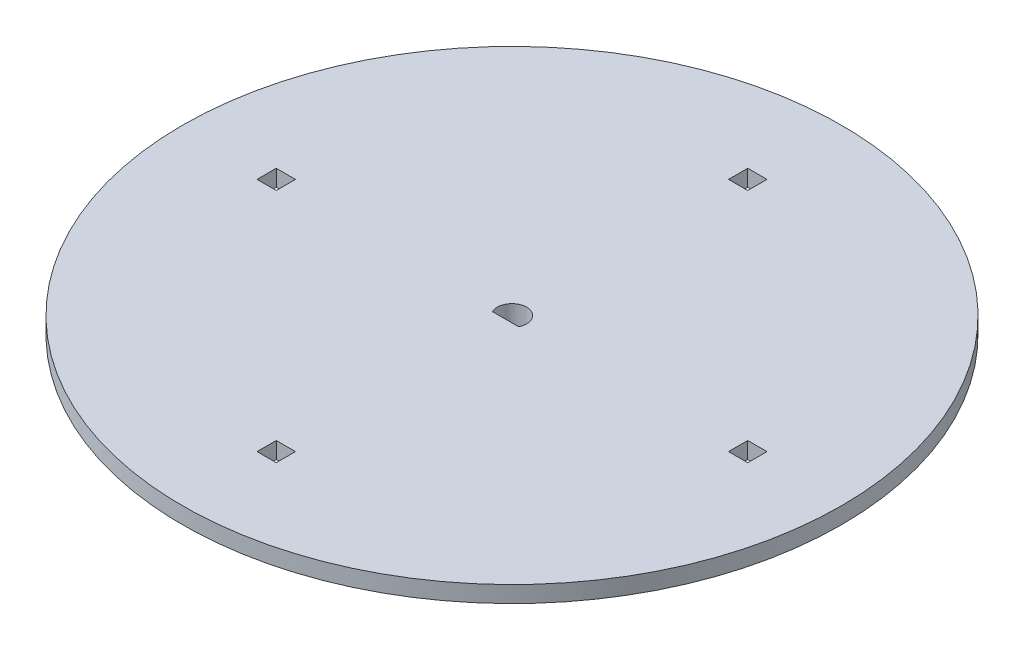
ISO-10303-21;
HEADER;
FILE_DESCRIPTION(('STEP AP214'),'2;1');
FILE_NAME('part.step','',(''),(''),'','','');
FILE_SCHEMA(('AUTOMOTIVE_DESIGN { 1 0 10303 214 1 1 1 1 }'));
ENDSEC;
DATA;
#1=APPLICATION_CONTEXT('core data for automotive mechanical design processes');
#2=APPLICATION_PROTOCOL_DEFINITION('international standard','automotive_design',2000,#1);
#3=PRODUCT_CONTEXT('',#1,'mechanical');
#4=PRODUCT('Part','Part','',(#3));
#5=PRODUCT_RELATED_PRODUCT_CATEGORY('part','',(#4));
#6=PRODUCT_DEFINITION_FORMATION('','',#4);
#7=PRODUCT_DEFINITION_CONTEXT('part definition',#1,'design');
#8=PRODUCT_DEFINITION('design','',#6,#7);
#9=PRODUCT_DEFINITION_SHAPE('','',#8);
#10=(LENGTH_UNIT() NAMED_UNIT(*) SI_UNIT(.MILLI.,.METRE.));
#11=(NAMED_UNIT(*) PLANE_ANGLE_UNIT() SI_UNIT($,.RADIAN.));
#12=(NAMED_UNIT(*) SI_UNIT($,.STERADIAN.) SOLID_ANGLE_UNIT());
#13=UNCERTAINTY_MEASURE_WITH_UNIT(LENGTH_MEASURE(1.E-05),#10,'distance_accuracy_value','');
#14=(GEOMETRIC_REPRESENTATION_CONTEXT(3) GLOBAL_UNCERTAINTY_ASSIGNED_CONTEXT((#13)) GLOBAL_UNIT_ASSIGNED_CONTEXT((#10,
#11,#12)) REPRESENTATION_CONTEXT('',''));
#15=CARTESIAN_POINT('',(0.,0.,0.));
#16=DIRECTION('',(0.,0.,1.));
#17=DIRECTION('',(1.,0.,0.));
#18=AXIS2_PLACEMENT_3D('',#15,#16,#17);
#19=CARTESIAN_POINT('',(0.,0.,0.));
#20=DIRECTION('',(0.,1.,0.));
#21=DIRECTION('',(-1.,0.,0.));
#22=AXIS2_PLACEMENT_3D('',#19,#20,#21);
#23=CYLINDRICAL_SURFACE('',#22,60.);
#24=CARTESIAN_POINT('',(0.,-3.00000000000001,0.));
#25=DIRECTION('',(0.,1.,0.));
#26=DIRECTION('',(-1.,0.,0.));
#27=AXIS2_PLACEMENT_3D('',#24,#25,#26);
#28=CIRCLE('',#27,60.);
#29=CARTESIAN_POINT('',(-60.,-3.00000000000001,0.));
#30=VERTEX_POINT('',#29);
#31=EDGE_CURVE('E309',#30,#30,#28,.T.);
#32=ORIENTED_EDGE('',*,*,#31,.T.);
#33=EDGE_LOOP('',(#32));
#34=FACE_BOUND('',#33,.T.);
#35=CARTESIAN_POINT('',(0.,0.,0.));
#36=DIRECTION('',(0.,1.,0.));
#37=DIRECTION('',(-1.,0.,0.));
#38=AXIS2_PLACEMENT_3D('',#35,#36,#37);
#39=CIRCLE('',#38,60.);
#40=CARTESIAN_POINT('',(-60.,0.,0.));
#41=VERTEX_POINT('',#40);
#42=EDGE_CURVE('E324',#41,#41,#39,.T.);
#43=ORIENTED_EDGE('',*,*,#42,.F.);
#44=EDGE_LOOP('',(#43));
#45=FACE_BOUND('',#44,.T.);
#46=ADVANCED_FACE('F41',(#34,#45),#23,.T.);
#47=CARTESIAN_POINT('',(0.,0.,0.));
#48=DIRECTION('',(0.,1.,0.));
#49=DIRECTION('',(-1.,0.,0.));
#50=AXIS2_PLACEMENT_3D('',#47,#48,#49);
#51=PLANE('',#50);
#52=DIRECTION('',(0.,0.,1.));
#53=VECTOR('',#52,1.);
#54=CARTESIAN_POINT('',(-1.75,0.,41.17));
#55=LINE('',#54,#53);
#56=CARTESIAN_POINT('',(-1.75,0.,41.17));
#57=VERTEX_POINT('',#56);
#58=CARTESIAN_POINT('',(-1.75,0.,44.67));
#59=VERTEX_POINT('',#58);
#60=EDGE_CURVE('E56',#57,#59,#55,.T.);
#61=ORIENTED_EDGE('',*,*,#60,.F.);
#62=DIRECTION('',(-1.,0.,0.));
#63=VECTOR('',#62,1.);
#64=CARTESIAN_POINT('',(1.75,0.,41.17));
#65=LINE('',#64,#63);
#66=CARTESIAN_POINT('',(1.75,0.,41.17));
#67=VERTEX_POINT('',#66);
#68=EDGE_CURVE('E249',#67,#57,#65,.T.);
#69=ORIENTED_EDGE('',*,*,#68,.F.);
#70=DIRECTION('',(0.,0.,-1.));
#71=VECTOR('',#70,1.);
#72=CARTESIAN_POINT('',(1.75,0.,41.17));
#73=LINE('',#72,#71);
#74=CARTESIAN_POINT('',(1.75,0.,44.67));
#75=VERTEX_POINT('',#74);
#76=EDGE_CURVE('E245',#75,#67,#73,.T.);
#77=ORIENTED_EDGE('',*,*,#76,.F.);
#78=DIRECTION('',(1.,0.,0.));
#79=VECTOR('',#78,1.);
#80=CARTESIAN_POINT('',(1.75,0.,44.67));
#81=LINE('',#80,#79);
#82=EDGE_CURVE('E240',#59,#75,#81,.T.);
#83=ORIENTED_EDGE('',*,*,#82,.F.);
#84=EDGE_LOOP('',(#61,#69,#77,#83));
#85=FACE_BOUND('',#84,.T.);
#86=DIRECTION('',(0.,0.,1.));
#87=VECTOR('',#86,1.);
#88=CARTESIAN_POINT('',(-44.67,0.,1.75));
#89=LINE('',#88,#87);
#90=CARTESIAN_POINT('',(-44.67,0.,-1.75));
#91=VERTEX_POINT('',#90);
#92=CARTESIAN_POINT('',(-44.67,0.,1.75));
#93=VERTEX_POINT('',#92);
#94=EDGE_CURVE('E64',#91,#93,#89,.T.);
#95=ORIENTED_EDGE('',*,*,#94,.F.);
#96=DIRECTION('',(-1.,0.,0.));
#97=VECTOR('',#96,1.);
#98=CARTESIAN_POINT('',(-41.17,0.,-1.75));
#99=LINE('',#98,#97);
#100=CARTESIAN_POINT('',(-41.17,0.,-1.75));
#101=VERTEX_POINT('',#100);
#102=EDGE_CURVE('E276',#101,#91,#99,.T.);
#103=ORIENTED_EDGE('',*,*,#102,.F.);
#104=DIRECTION('',(0.,0.,-1.));
#105=VECTOR('',#104,1.);
#106=CARTESIAN_POINT('',(-41.17,0.,1.75));
#107=LINE('',#106,#105);
#108=CARTESIAN_POINT('',(-41.17,0.,1.75));
#109=VERTEX_POINT('',#108);
#110=EDGE_CURVE('E272',#109,#101,#107,.T.);
#111=ORIENTED_EDGE('',*,*,#110,.F.);
#112=DIRECTION('',(1.,0.,0.));
#113=VECTOR('',#112,1.);
#114=CARTESIAN_POINT('',(-41.17,0.,1.75));
#115=LINE('',#114,#113);
#116=EDGE_CURVE('E268',#93,#109,#115,.T.);
#117=ORIENTED_EDGE('',*,*,#116,.F.);
#118=EDGE_LOOP('',(#95,#103,#111,#117));
#119=FACE_BOUND('',#118,.T.);
#120=DIRECTION('',(-1.,0.,0.));
#121=VECTOR('',#120,1.);
#122=CARTESIAN_POINT('',(-1.75000000000001,0.,-44.67));
#123=LINE('',#122,#121);
#124=CARTESIAN_POINT('',(1.74999999999999,0.,-44.67));
#125=VERTEX_POINT('',#124);
#126=CARTESIAN_POINT('',(-1.75000000000001,0.,-44.67));
#127=VERTEX_POINT('',#126);
#128=EDGE_CURVE('E191',#125,#127,#123,.T.);
#129=ORIENTED_EDGE('',*,*,#128,.F.);
#130=DIRECTION('',(0.,0.,-1.));
#131=VECTOR('',#130,1.);
#132=CARTESIAN_POINT('',(1.74999999999999,0.,-41.17));
#133=LINE('',#132,#131);
#134=CARTESIAN_POINT('',(1.74999999999999,0.,-41.17));
#135=VERTEX_POINT('',#134);
#136=EDGE_CURVE('E196',#135,#125,#133,.T.);
#137=ORIENTED_EDGE('',*,*,#136,.F.);
#138=DIRECTION('',(1.,0.,0.));
#139=VECTOR('',#138,1.);
#140=CARTESIAN_POINT('',(-1.75000000000001,0.,-41.17));
#141=LINE('',#140,#139);
#142=CARTESIAN_POINT('',(-1.75000000000001,0.,-41.17));
#143=VERTEX_POINT('',#142);
#144=EDGE_CURVE('E173',#143,#135,#141,.T.);
#145=ORIENTED_EDGE('',*,*,#144,.F.);
#146=DIRECTION('',(0.,0.,1.));
#147=VECTOR('',#146,1.);
#148=CARTESIAN_POINT('',(-1.75000000000001,0.,-41.17));
#149=LINE('',#148,#147);
#150=EDGE_CURVE('E185',#127,#143,#149,.T.);
#151=ORIENTED_EDGE('',*,*,#150,.F.);
#152=EDGE_LOOP('',(#129,#137,#145,#151));
#153=FACE_BOUND('',#152,.T.);
#154=DIRECTION('',(0.,0.,-1.));
#155=VECTOR('',#154,1.);
#156=CARTESIAN_POINT('',(44.67,0.,-1.75000000000001));
#157=LINE('',#156,#155);
#158=CARTESIAN_POINT('',(44.67,0.,1.74999999999999));
#159=VERTEX_POINT('',#158);
#160=CARTESIAN_POINT('',(44.67,0.,-1.75000000000001));
#161=VERTEX_POINT('',#160);
#162=EDGE_CURVE('E210',#159,#161,#157,.T.);
#163=ORIENTED_EDGE('',*,*,#162,.F.);
#164=DIRECTION('',(1.,0.,0.));
#165=VECTOR('',#164,1.);
#166=CARTESIAN_POINT('',(41.17,0.,1.74999999999999));
#167=LINE('',#166,#165);
#168=CARTESIAN_POINT('',(41.17,0.,1.74999999999999));
#169=VERTEX_POINT('',#168);
#170=EDGE_CURVE('E221',#169,#159,#167,.T.);
#171=ORIENTED_EDGE('',*,*,#170,.F.);
#172=DIRECTION('',(0.,0.,1.));
#173=VECTOR('',#172,1.);
#174=CARTESIAN_POINT('',(41.17,0.,-1.75000000000001));
#175=LINE('',#174,#173);
#176=CARTESIAN_POINT('',(41.17,0.,-1.75000000000001));
#177=VERTEX_POINT('',#176);
#178=EDGE_CURVE('E217',#177,#169,#175,.T.);
#179=ORIENTED_EDGE('',*,*,#178,.F.);
#180=DIRECTION('',(-1.,0.,0.));
#181=VECTOR('',#180,1.);
#182=CARTESIAN_POINT('',(41.17,0.,-1.75000000000001));
#183=LINE('',#182,#181);
#184=EDGE_CURVE('E213',#161,#177,#183,.T.);
#185=ORIENTED_EDGE('',*,*,#184,.F.);
#186=EDGE_LOOP('',(#163,#171,#179,#185));
#187=FACE_BOUND('',#186,.T.);
#188=CARTESIAN_POINT('',(0.,0.,0.));
#189=DIRECTION('',(0.,1.,0.));
#190=DIRECTION('',(-1.,0.,0.));
#191=AXIS2_PLACEMENT_3D('',#188,#189,#190);
#192=CIRCLE('',#191,2.65);
#193=CARTESIAN_POINT('',(2.37773000990441,0.,1.17));
#194=VERTEX_POINT('',#193);
#195=CARTESIAN_POINT('',(-2.37773000990441,0.,1.17));
#196=VERTEX_POINT('',#195);
#197=EDGE_CURVE('E257',#194,#196,#192,.T.);
#198=ORIENTED_EDGE('',*,*,#197,.F.);
#199=DIRECTION('',(1.,0.,0.));
#200=VECTOR('',#199,1.);
#201=CARTESIAN_POINT('',(2.37773000990441,0.,1.17));
#202=LINE('',#201,#200);
#203=EDGE_CURVE('E296',#196,#194,#202,.T.);
#204=ORIENTED_EDGE('',*,*,#203,.F.);
#205=EDGE_LOOP('',(#198,#204));
#206=FACE_BOUND('',#205,.T.);
#207=ORIENTED_EDGE('',*,*,#42,.T.);
#208=EDGE_LOOP('',(#207));
#209=FACE_BOUND('',#208,.T.);
#210=ADVANCED_FACE('F193',(#85,#119,#153,#187,#206,#209),#51,.T.);
#211=CARTESIAN_POINT('',(0.,-7.1086,0.));
#212=DIRECTION('',(0.,1.,0.));
#213=DIRECTION('',(-1.,0.,0.));
#214=AXIS2_PLACEMENT_3D('',#211,#212,#213);
#215=PLANE('',#214);
#216=DIRECTION('',(1.,0.,0.));
#217=VECTOR('',#216,1.);
#218=CARTESIAN_POINT('',(2.37773000990441,-7.10860000000001,1.17));
#219=LINE('',#218,#217);
#220=CARTESIAN_POINT('',(-2.3777300099044,-7.10860000000001,1.17));
#221=VERTEX_POINT('',#220);
#222=CARTESIAN_POINT('',(2.37773000990441,-7.1086,1.17));
#223=VERTEX_POINT('',#222);
#224=EDGE_CURVE('E295',#221,#223,#219,.T.);
#225=ORIENTED_EDGE('',*,*,#224,.T.);
#226=CARTESIAN_POINT('',(0.,-7.10860000000001,0.));
#227=DIRECTION('',(0.,1.,0.));
#228=DIRECTION('',(-1.,0.,0.));
#229=AXIS2_PLACEMENT_3D('',#226,#227,#228);
#230=CIRCLE('',#229,2.65);
#231=EDGE_CURVE('E291',#223,#221,#230,.T.);
#232=ORIENTED_EDGE('',*,*,#231,.T.);
#233=EDGE_LOOP('',(#225,#232));
#234=FACE_BOUND('',#233,.T.);
#235=CARTESIAN_POINT('',(0.,-7.1086,0.));
#236=DIRECTION('',(0.,1.,0.));
#237=DIRECTION('',(-1.,0.,0.));
#238=AXIS2_PLACEMENT_3D('',#235,#236,#237);
#239=CIRCLE('',#238,3.0734);
#240=CARTESIAN_POINT('',(-3.0734,-7.1086,0.));
#241=VERTEX_POINT('',#240);
#242=EDGE_CURVE('E320',#241,#241,#239,.T.);
#243=ORIENTED_EDGE('',*,*,#242,.F.);
#244=EDGE_LOOP('',(#243));
#245=FACE_BOUND('',#244,.T.);
#246=ADVANCED_FACE('F418',(#234,#245),#215,.F.);
#247=CARTESIAN_POINT('',(0.,0.,0.));
#248=DIRECTION('',(0.,1.,0.));
#249=DIRECTION('',(-1.,0.,0.));
#250=AXIS2_PLACEMENT_3D('',#247,#248,#249);
#251=CYLINDRICAL_SURFACE('',#250,3.0734);
#252=ORIENTED_EDGE('',*,*,#242,.T.);
#253=EDGE_LOOP('',(#252));
#254=FACE_BOUND('',#253,.T.);
#255=CARTESIAN_POINT('',(0.,-3.,0.));
#256=DIRECTION('',(0.,1.,0.));
#257=DIRECTION('',(-1.,0.,0.));
#258=AXIS2_PLACEMENT_3D('',#255,#256,#257);
#259=CIRCLE('',#258,3.0734);
#260=CARTESIAN_POINT('',(-3.0734,-3.,0.));
#261=VERTEX_POINT('',#260);
#262=EDGE_CURVE('E316',#261,#261,#259,.T.);
#263=ORIENTED_EDGE('',*,*,#262,.F.);
#264=EDGE_LOOP('',(#263));
#265=FACE_BOUND('',#264,.T.);
#266=ADVANCED_FACE('F427',(#254,#265),#251,.T.);
#267=CARTESIAN_POINT('',(0.,-3.,0.));
#268=DIRECTION('',(0.,1.,0.));
#269=DIRECTION('',(-1.,0.,0.));
#270=AXIS2_PLACEMENT_3D('',#267,#268,#269);
#271=PLANE('',#270);
#272=DIRECTION('',(-1.,0.,0.));
#273=VECTOR('',#272,1.);
#274=CARTESIAN_POINT('',(0.,-3.,41.17));
#275=LINE('',#274,#273);
#276=CARTESIAN_POINT('',(1.75,-3.,41.17));
#277=VERTEX_POINT('',#276);
#278=CARTESIAN_POINT('',(-1.75,-3.,41.17));
#279=VERTEX_POINT('',#278);
#280=EDGE_CURVE('E49',#277,#279,#275,.T.);
#281=ORIENTED_EDGE('',*,*,#280,.T.);
#282=DIRECTION('',(0.,0.,1.));
#283=VECTOR('',#282,1.);
#284=CARTESIAN_POINT('',(-1.75,-3.,0.));
#285=LINE('',#284,#283);
#286=CARTESIAN_POINT('',(-1.75,-3.,44.67));
#287=VERTEX_POINT('',#286);
#288=EDGE_CURVE('E11',#279,#287,#285,.T.);
#289=ORIENTED_EDGE('',*,*,#288,.T.);
#290=DIRECTION('',(1.,0.,0.));
#291=VECTOR('',#290,1.);
#292=CARTESIAN_POINT('',(0.,-3.,44.67));
#293=LINE('',#292,#291);
#294=CARTESIAN_POINT('',(1.75,-3.,44.67));
#295=VERTEX_POINT('',#294);
#296=EDGE_CURVE('E373',#287,#295,#293,.T.);
#297=ORIENTED_EDGE('',*,*,#296,.T.);
#298=DIRECTION('',(0.,0.,-1.));
#299=VECTOR('',#298,1.);
#300=CARTESIAN_POINT('',(1.75,-3.,0.));
#301=LINE('',#300,#299);
#302=EDGE_CURVE('E377',#295,#277,#301,.T.);
#303=ORIENTED_EDGE('',*,*,#302,.T.);
#304=EDGE_LOOP('',(#281,#289,#297,#303));
#305=FACE_BOUND('',#304,.T.);
#306=DIRECTION('',(-1.,0.,0.));
#307=VECTOR('',#306,1.);
#308=CARTESIAN_POINT('',(0.,-3.,-1.75));
#309=LINE('',#308,#307);
#310=CARTESIAN_POINT('',(-41.17,-3.00000000000001,-1.75));
#311=VERTEX_POINT('',#310);
#312=CARTESIAN_POINT('',(-44.67,-3.00000000000001,-1.75));
#313=VERTEX_POINT('',#312);
#314=EDGE_CURVE('E365',#311,#313,#309,.T.);
#315=ORIENTED_EDGE('',*,*,#314,.T.);
#316=DIRECTION('',(0.,0.,1.));
#317=VECTOR('',#316,1.);
#318=CARTESIAN_POINT('',(-44.67,-3.00000000000001,0.));
#319=LINE('',#318,#317);
#320=CARTESIAN_POINT('',(-44.67,-3.00000000000001,1.75));
#321=VERTEX_POINT('',#320);
#322=EDGE_CURVE('E369',#313,#321,#319,.T.);
#323=ORIENTED_EDGE('',*,*,#322,.T.);
#324=DIRECTION('',(1.,0.,0.));
#325=VECTOR('',#324,1.);
#326=CARTESIAN_POINT('',(0.,-3.,1.75));
#327=LINE('',#326,#325);
#328=CARTESIAN_POINT('',(-41.17,-3.00000000000001,1.75));
#329=VERTEX_POINT('',#328);
#330=EDGE_CURVE('E357',#321,#329,#327,.T.);
#331=ORIENTED_EDGE('',*,*,#330,.T.);
#332=DIRECTION('',(0.,0.,-1.));
#333=VECTOR('',#332,1.);
#334=CARTESIAN_POINT('',(-41.17,-3.00000000000001,0.));
#335=LINE('',#334,#333);
#336=EDGE_CURVE('E361',#329,#311,#335,.T.);
#337=ORIENTED_EDGE('',*,*,#336,.T.);
#338=EDGE_LOOP('',(#315,#323,#331,#337));
#339=FACE_BOUND('',#338,.T.);
#340=DIRECTION('',(0.,0.,-1.));
#341=VECTOR('',#340,1.);
#342=CARTESIAN_POINT('',(1.75000000000001,-3.,0.));
#343=LINE('',#342,#341);
#344=CARTESIAN_POINT('',(1.75,-3.,-41.17));
#345=VERTEX_POINT('',#344);
#346=CARTESIAN_POINT('',(1.74999999999999,-3.,-44.67));
#347=VERTEX_POINT('',#346);
#348=EDGE_CURVE('E349',#345,#347,#343,.T.);
#349=ORIENTED_EDGE('',*,*,#348,.T.);
#350=DIRECTION('',(-1.,0.,0.));
#351=VECTOR('',#350,1.);
#352=CARTESIAN_POINT('',(0.,-3.,-44.67));
#353=LINE('',#352,#351);
#354=CARTESIAN_POINT('',(-1.75000000000001,-3.,-44.67));
#355=VERTEX_POINT('',#354);
#356=EDGE_CURVE('E353',#347,#355,#353,.T.);
#357=ORIENTED_EDGE('',*,*,#356,.T.);
#358=DIRECTION('',(0.,0.,1.));
#359=VECTOR('',#358,1.);
#360=CARTESIAN_POINT('',(-1.74999999999999,-3.,0.));
#361=LINE('',#360,#359);
#362=CARTESIAN_POINT('',(-1.75,-3.,-41.17));
#363=VERTEX_POINT('',#362);
#364=EDGE_CURVE('E344',#355,#363,#361,.T.);
#365=ORIENTED_EDGE('',*,*,#364,.T.);
#366=DIRECTION('',(1.,0.,0.));
#367=VECTOR('',#366,1.);
#368=CARTESIAN_POINT('',(0.,-3.,-41.17));
#369=LINE('',#368,#367);
#370=EDGE_CURVE('E176',#363,#345,#369,.T.);
#371=ORIENTED_EDGE('',*,*,#370,.T.);
#372=EDGE_LOOP('',(#349,#357,#365,#371));
#373=FACE_BOUND('',#372,.T.);
#374=DIRECTION('',(1.,0.,0.));
#375=VECTOR('',#374,1.);
#376=CARTESIAN_POINT('',(0.,-3.,1.75));
#377=LINE('',#376,#375);
#378=CARTESIAN_POINT('',(41.17,-3.,1.74999999999999));
#379=VERTEX_POINT('',#378);
#380=CARTESIAN_POINT('',(44.67,-3.,1.74999999999999));
#381=VERTEX_POINT('',#380);
#382=EDGE_CURVE('E336',#379,#381,#377,.T.);
#383=ORIENTED_EDGE('',*,*,#382,.T.);
#384=DIRECTION('',(0.,0.,-1.));
#385=VECTOR('',#384,1.);
#386=CARTESIAN_POINT('',(44.67,-3.,0.));
#387=LINE('',#386,#385);
#388=CARTESIAN_POINT('',(44.67,-3.,-1.75000000000001));
#389=VERTEX_POINT('',#388);
#390=EDGE_CURVE('E340',#381,#389,#387,.T.);
#391=ORIENTED_EDGE('',*,*,#390,.T.);
#392=DIRECTION('',(-1.,0.,0.));
#393=VECTOR('',#392,1.);
#394=CARTESIAN_POINT('',(0.,-3.,-1.74999999999999));
#395=LINE('',#394,#393);
#396=CARTESIAN_POINT('',(41.17,-3.,-1.75000000000001));
#397=VERTEX_POINT('',#396);
#398=EDGE_CURVE('E328',#389,#397,#395,.T.);
#399=ORIENTED_EDGE('',*,*,#398,.T.);
#400=DIRECTION('',(0.,0.,1.));
#401=VECTOR('',#400,1.);
#402=CARTESIAN_POINT('',(41.17,-3.,0.));
#403=LINE('',#402,#401);
#404=EDGE_CURVE('E332',#397,#379,#403,.T.);
#405=ORIENTED_EDGE('',*,*,#404,.T.);
#406=EDGE_LOOP('',(#383,#391,#399,#405));
#407=FACE_BOUND('',#406,.T.);
#408=ORIENTED_EDGE('',*,*,#31,.F.);
#409=EDGE_LOOP('',(#408));
#410=FACE_BOUND('',#409,.T.);
#411=ORIENTED_EDGE('',*,*,#262,.T.);
#412=EDGE_LOOP('',(#411));
#413=FACE_BOUND('',#412,.T.);
#414=ADVANCED_FACE('F383',(#305,#339,#373,#407,#410,#413),#271,.F.);
#415=CARTESIAN_POINT('',(44.67,-7.1086,-1.75000000000001));
#416=DIRECTION('',(1.,0.,0.));
#417=DIRECTION('',(0.,1.,0.));
#418=AXIS2_PLACEMENT_3D('',#415,#416,#417);
#419=PLANE('',#418);
#420=DIRECTION('',(0.,1.,0.));
#421=VECTOR('',#420,1.);
#422=CARTESIAN_POINT('',(44.67,-7.1086,1.74999999999999));
#423=LINE('',#422,#421);
#424=EDGE_CURVE('E226',#381,#159,#423,.T.);
#425=ORIENTED_EDGE('',*,*,#424,.T.);
#426=ORIENTED_EDGE('',*,*,#162,.T.);
#427=DIRECTION('',(0.,1.,0.));
#428=VECTOR('',#427,1.);
#429=CARTESIAN_POINT('',(44.67,-7.1086,-1.75000000000001));
#430=LINE('',#429,#428);
#431=EDGE_CURVE('E225',#389,#161,#430,.T.);
#432=ORIENTED_EDGE('',*,*,#431,.F.);
#433=ORIENTED_EDGE('',*,*,#390,.F.);
#434=EDGE_LOOP('',(#425,#426,#432,#433));
#435=FACE_BOUND('',#434,.T.);
#436=ADVANCED_FACE('F426',(#435),#419,.F.);
#437=CARTESIAN_POINT('',(41.17,-7.1086,1.74999999999999));
#438=DIRECTION('',(0.,0.,1.));
#439=DIRECTION('',(1.,0.,0.));
#440=AXIS2_PLACEMENT_3D('',#437,#438,#439);
#441=PLANE('',#440);
#442=DIRECTION('',(0.,1.,0.));
#443=VECTOR('',#442,1.);
#444=CARTESIAN_POINT('',(41.17,-7.1086,1.74999999999999));
#445=LINE('',#444,#443);
#446=EDGE_CURVE('E229',#379,#169,#445,.T.);
#447=ORIENTED_EDGE('',*,*,#446,.T.);
#448=ORIENTED_EDGE('',*,*,#170,.T.);
#449=ORIENTED_EDGE('',*,*,#424,.F.);
#450=ORIENTED_EDGE('',*,*,#382,.F.);
#451=EDGE_LOOP('',(#447,#448,#449,#450));
#452=FACE_BOUND('',#451,.T.);
#453=ADVANCED_FACE('F470',(#452),#441,.F.);
#454=CARTESIAN_POINT('',(41.17,-7.1086,-1.75000000000001));
#455=DIRECTION('',(-1.,0.,0.));
#456=DIRECTION('',(0.,-1.,0.));
#457=AXIS2_PLACEMENT_3D('',#454,#455,#456);
#458=PLANE('',#457);
#459=DIRECTION('',(0.,1.,0.));
#460=VECTOR('',#459,1.);
#461=CARTESIAN_POINT('',(41.17,-7.1086,-1.75000000000001));
#462=LINE('',#461,#460);
#463=EDGE_CURVE('E232',#397,#177,#462,.T.);
#464=ORIENTED_EDGE('',*,*,#463,.T.);
#465=ORIENTED_EDGE('',*,*,#178,.T.);
#466=ORIENTED_EDGE('',*,*,#446,.F.);
#467=ORIENTED_EDGE('',*,*,#404,.F.);
#468=EDGE_LOOP('',(#464,#465,#466,#467));
#469=FACE_BOUND('',#468,.T.);
#470=ADVANCED_FACE('F472',(#469),#458,.F.);
#471=CARTESIAN_POINT('',(41.17,-7.1086,-1.75000000000001));
#472=DIRECTION('',(0.,0.,-1.));
#473=DIRECTION('',(-1.,0.,0.));
#474=AXIS2_PLACEMENT_3D('',#471,#472,#473);
#475=PLANE('',#474);
#476=ORIENTED_EDGE('',*,*,#431,.T.);
#477=ORIENTED_EDGE('',*,*,#184,.T.);
#478=ORIENTED_EDGE('',*,*,#463,.F.);
#479=ORIENTED_EDGE('',*,*,#398,.F.);
#480=EDGE_LOOP('',(#476,#477,#478,#479));
#481=FACE_BOUND('',#480,.T.);
#482=ADVANCED_FACE('F481',(#481),#475,.F.);
#483=CARTESIAN_POINT('',(-1.75000000000001,-7.10860000000001,-44.67));
#484=DIRECTION('',(0.,0.,-1.));
#485=DIRECTION('',(-1.,0.,0.));
#486=AXIS2_PLACEMENT_3D('',#483,#484,#485);
#487=PLANE('',#486);
#488=DIRECTION('',(0.,1.,0.));
#489=VECTOR('',#488,1.);
#490=CARTESIAN_POINT('',(1.74999999999999,-7.10860000000001,-44.67));
#491=LINE('',#490,#489);
#492=EDGE_CURVE('E203',#347,#125,#491,.T.);
#493=ORIENTED_EDGE('',*,*,#492,.T.);
#494=ORIENTED_EDGE('',*,*,#128,.T.);
#495=DIRECTION('',(0.,1.,0.));
#496=VECTOR('',#495,1.);
#497=CARTESIAN_POINT('',(-1.75000000000001,-7.10860000000001,-44.67));
#498=LINE('',#497,#496);
#499=EDGE_CURVE('E181',#355,#127,#498,.T.);
#500=ORIENTED_EDGE('',*,*,#499,.F.);
#501=ORIENTED_EDGE('',*,*,#356,.F.);
#502=EDGE_LOOP('',(#493,#494,#500,#501));
#503=FACE_BOUND('',#502,.T.);
#504=ADVANCED_FACE('F483',(#503),#487,.F.);
#505=CARTESIAN_POINT('',(1.75,-7.10860000000001,-41.17));
#506=DIRECTION('',(1.,0.,0.));
#507=DIRECTION('',(0.,0.,-1.));
#508=AXIS2_PLACEMENT_3D('',#505,#506,#507);
#509=PLANE('',#508);
#510=DIRECTION('',(0.,1.,0.));
#511=VECTOR('',#510,1.);
#512=CARTESIAN_POINT('',(1.75,-7.10860000000001,-41.17));
#513=LINE('',#512,#511);
#514=EDGE_CURVE('E180',#345,#135,#513,.T.);
#515=ORIENTED_EDGE('',*,*,#514,.T.);
#516=ORIENTED_EDGE('',*,*,#136,.T.);
#517=ORIENTED_EDGE('',*,*,#492,.F.);
#518=ORIENTED_EDGE('',*,*,#348,.F.);
#519=EDGE_LOOP('',(#515,#516,#517,#518));
#520=FACE_BOUND('',#519,.T.);
#521=ADVANCED_FACE('F489',(#520),#509,.F.);
#522=CARTESIAN_POINT('',(-1.75,-7.10860000000001,-41.17));
#523=DIRECTION('',(0.,0.,1.));
#524=DIRECTION('',(1.,0.,0.));
#525=AXIS2_PLACEMENT_3D('',#522,#523,#524);
#526=PLANE('',#525);
#527=DIRECTION('',(0.,1.,0.));
#528=VECTOR('',#527,1.);
#529=CARTESIAN_POINT('',(-1.75,-7.10860000000001,-41.17));
#530=LINE('',#529,#528);
#531=EDGE_CURVE('E168',#363,#143,#530,.T.);
#532=ORIENTED_EDGE('',*,*,#531,.T.);
#533=ORIENTED_EDGE('',*,*,#144,.T.);
#534=ORIENTED_EDGE('',*,*,#514,.F.);
#535=ORIENTED_EDGE('',*,*,#370,.F.);
#536=EDGE_LOOP('',(#532,#533,#534,#535));
#537=FACE_BOUND('',#536,.T.);
#538=ADVANCED_FACE('F170',(#537),#526,.F.);
#539=CARTESIAN_POINT('',(-1.75,-7.10860000000001,-41.17));
#540=DIRECTION('',(-1.,0.,0.));
#541=DIRECTION('',(0.,0.,1.));
#542=AXIS2_PLACEMENT_3D('',#539,#540,#541);
#543=PLANE('',#542);
#544=ORIENTED_EDGE('',*,*,#499,.T.);
#545=ORIENTED_EDGE('',*,*,#150,.T.);
#546=ORIENTED_EDGE('',*,*,#531,.F.);
#547=ORIENTED_EDGE('',*,*,#364,.F.);
#548=EDGE_LOOP('',(#544,#545,#546,#547));
#549=FACE_BOUND('',#548,.T.);
#550=ADVANCED_FACE('F186',(#549),#543,.F.);
#551=CARTESIAN_POINT('',(-44.67,-7.10860000000001,1.75));
#552=DIRECTION('',(-1.,0.,0.));
#553=DIRECTION('',(0.,-1.,0.));
#554=AXIS2_PLACEMENT_3D('',#551,#552,#553);
#555=PLANE('',#554);
#556=DIRECTION('',(0.,1.,0.));
#557=VECTOR('',#556,1.);
#558=CARTESIAN_POINT('',(-44.67,-7.10860000000001,-1.75));
#559=LINE('',#558,#557);
#560=EDGE_CURVE('E241',#313,#91,#559,.T.);
#561=ORIENTED_EDGE('',*,*,#560,.T.);
#562=ORIENTED_EDGE('',*,*,#94,.T.);
#563=DIRECTION('',(0.,1.,0.));
#564=VECTOR('',#563,1.);
#565=CARTESIAN_POINT('',(-44.67,-7.10860000000001,1.75));
#566=LINE('',#565,#564);
#567=EDGE_CURVE('E280',#321,#93,#566,.T.);
#568=ORIENTED_EDGE('',*,*,#567,.F.);
#569=ORIENTED_EDGE('',*,*,#322,.F.);
#570=EDGE_LOOP('',(#561,#562,#568,#569));
#571=FACE_BOUND('',#570,.T.);
#572=ADVANCED_FACE('F448',(#571),#555,.F.);
#573=CARTESIAN_POINT('',(-41.17,-7.10860000000001,-1.75));
#574=DIRECTION('',(0.,0.,-1.));
#575=DIRECTION('',(-1.,0.,0.));
#576=AXIS2_PLACEMENT_3D('',#573,#574,#575);
#577=PLANE('',#576);
#578=DIRECTION('',(0.,1.,0.));
#579=VECTOR('',#578,1.);
#580=CARTESIAN_POINT('',(-41.17,-7.10860000000001,-1.75));
#581=LINE('',#580,#579);
#582=EDGE_CURVE('E283',#311,#101,#581,.T.);
#583=ORIENTED_EDGE('',*,*,#582,.T.);
#584=ORIENTED_EDGE('',*,*,#102,.T.);
#585=ORIENTED_EDGE('',*,*,#560,.F.);
#586=ORIENTED_EDGE('',*,*,#314,.F.);
#587=EDGE_LOOP('',(#583,#584,#585,#586));
#588=FACE_BOUND('',#587,.T.);
#589=ADVANCED_FACE('F450',(#588),#577,.F.);
#590=CARTESIAN_POINT('',(-41.17,-7.10860000000001,1.75));
#591=DIRECTION('',(1.,0.,0.));
#592=DIRECTION('',(0.,1.,0.));
#593=AXIS2_PLACEMENT_3D('',#590,#591,#592);
#594=PLANE('',#593);
#595=DIRECTION('',(0.,1.,0.));
#596=VECTOR('',#595,1.);
#597=CARTESIAN_POINT('',(-41.17,-7.10860000000001,1.75));
#598=LINE('',#597,#596);
#599=EDGE_CURVE('E286',#329,#109,#598,.T.);
#600=ORIENTED_EDGE('',*,*,#599,.T.);
#601=ORIENTED_EDGE('',*,*,#110,.T.);
#602=ORIENTED_EDGE('',*,*,#582,.F.);
#603=ORIENTED_EDGE('',*,*,#336,.F.);
#604=EDGE_LOOP('',(#600,#601,#602,#603));
#605=FACE_BOUND('',#604,.T.);
#606=ADVANCED_FACE('F408',(#605),#594,.F.);
#607=CARTESIAN_POINT('',(-41.17,-7.10860000000001,1.75));
#608=DIRECTION('',(0.,0.,1.));
#609=DIRECTION('',(1.,0.,0.));
#610=AXIS2_PLACEMENT_3D('',#607,#608,#609);
#611=PLANE('',#610);
#612=ORIENTED_EDGE('',*,*,#567,.T.);
#613=ORIENTED_EDGE('',*,*,#116,.T.);
#614=ORIENTED_EDGE('',*,*,#599,.F.);
#615=ORIENTED_EDGE('',*,*,#330,.F.);
#616=EDGE_LOOP('',(#612,#613,#614,#615));
#617=FACE_BOUND('',#616,.T.);
#618=ADVANCED_FACE('F401',(#617),#611,.F.);
#619=CARTESIAN_POINT('',(-1.75,-7.10860000000001,41.17));
#620=DIRECTION('',(-1.,0.,0.));
#621=DIRECTION('',(0.,0.,1.));
#622=AXIS2_PLACEMENT_3D('',#619,#620,#621);
#623=PLANE('',#622);
#624=DIRECTION('',(0.,1.,0.));
#625=VECTOR('',#624,1.);
#626=CARTESIAN_POINT('',(-1.75,-7.10860000000001,41.17));
#627=LINE('',#626,#625);
#628=EDGE_CURVE('E254',#279,#57,#627,.T.);
#629=ORIENTED_EDGE('',*,*,#628,.T.);
#630=ORIENTED_EDGE('',*,*,#60,.T.);
#631=DIRECTION('',(0.,1.,0.));
#632=VECTOR('',#631,1.);
#633=CARTESIAN_POINT('',(-1.75,-7.10860000000001,44.67));
#634=LINE('',#633,#632);
#635=EDGE_CURVE('E253',#287,#59,#634,.T.);
#636=ORIENTED_EDGE('',*,*,#635,.F.);
#637=ORIENTED_EDGE('',*,*,#288,.F.);
#638=EDGE_LOOP('',(#629,#630,#636,#637));
#639=FACE_BOUND('',#638,.T.);
#640=ADVANCED_FACE('F399',(#639),#623,.F.);
#641=CARTESIAN_POINT('',(1.75,-7.10860000000001,41.17));
#642=DIRECTION('',(0.,0.,-1.));
#643=DIRECTION('',(-1.,0.,0.));
#644=AXIS2_PLACEMENT_3D('',#641,#642,#643);
#645=PLANE('',#644);
#646=DIRECTION('',(0.,1.,0.));
#647=VECTOR('',#646,1.);
#648=CARTESIAN_POINT('',(1.75,-7.10860000000001,41.17));
#649=LINE('',#648,#647);
#650=EDGE_CURVE('E258',#277,#67,#649,.T.);
#651=ORIENTED_EDGE('',*,*,#650,.T.);
#652=ORIENTED_EDGE('',*,*,#68,.T.);
#653=ORIENTED_EDGE('',*,*,#628,.F.);
#654=ORIENTED_EDGE('',*,*,#280,.F.);
#655=EDGE_LOOP('',(#651,#652,#653,#654));
#656=FACE_BOUND('',#655,.T.);
#657=ADVANCED_FACE('F389',(#656),#645,.F.);
#658=CARTESIAN_POINT('',(1.75,-7.10860000000001,41.17));
#659=DIRECTION('',(1.,0.,0.));
#660=DIRECTION('',(0.,0.,-1.));
#661=AXIS2_PLACEMENT_3D('',#658,#659,#660);
#662=PLANE('',#661);
#663=DIRECTION('',(0.,1.,0.));
#664=VECTOR('',#663,1.);
#665=CARTESIAN_POINT('',(1.75,-7.10860000000001,44.67));
#666=LINE('',#665,#664);
#667=EDGE_CURVE('E261',#295,#75,#666,.T.);
#668=ORIENTED_EDGE('',*,*,#667,.T.);
#669=ORIENTED_EDGE('',*,*,#76,.T.);
#670=ORIENTED_EDGE('',*,*,#650,.F.);
#671=ORIENTED_EDGE('',*,*,#302,.F.);
#672=EDGE_LOOP('',(#668,#669,#670,#671));
#673=FACE_BOUND('',#672,.T.);
#674=ADVANCED_FACE('F391',(#673),#662,.F.);
#675=CARTESIAN_POINT('',(1.75,-7.10860000000001,44.67));
#676=DIRECTION('',(0.,0.,1.));
#677=DIRECTION('',(1.,0.,0.));
#678=AXIS2_PLACEMENT_3D('',#675,#676,#677);
#679=PLANE('',#678);
#680=ORIENTED_EDGE('',*,*,#635,.T.);
#681=ORIENTED_EDGE('',*,*,#82,.T.);
#682=ORIENTED_EDGE('',*,*,#667,.F.);
#683=ORIENTED_EDGE('',*,*,#296,.F.);
#684=EDGE_LOOP('',(#680,#681,#682,#683));
#685=FACE_BOUND('',#684,.T.);
#686=ADVANCED_FACE('F398',(#685),#679,.F.);
#687=CARTESIAN_POINT('',(0.,-7.10860000000001,0.));
#688=DIRECTION('',(0.,1.,0.));
#689=DIRECTION('',(-1.,0.,0.));
#690=AXIS2_PLACEMENT_3D('',#687,#688,#689);
#691=CYLINDRICAL_SURFACE('',#690,2.65);
#692=ORIENTED_EDGE('',*,*,#197,.T.);
#693=DIRECTION('',(0.,1.,0.));
#694=VECTOR('',#693,1.);
#695=CARTESIAN_POINT('',(-2.3777300099044,-7.10860000000001,1.17));
#696=LINE('',#695,#694);
#697=EDGE_CURVE('E300',#221,#196,#696,.T.);
#698=ORIENTED_EDGE('',*,*,#697,.F.);
#699=ORIENTED_EDGE('',*,*,#231,.F.);
#700=DIRECTION('',(0.,1.,0.));
#701=VECTOR('',#700,1.);
#702=CARTESIAN_POINT('',(2.37773000990441,-7.10860000000001,1.17));
#703=LINE('',#702,#701);
#704=EDGE_CURVE('E306',#223,#194,#703,.T.);
#705=ORIENTED_EDGE('',*,*,#704,.T.);
#706=EDGE_LOOP('',(#692,#698,#699,#705));
#707=FACE_BOUND('',#706,.T.);
#708=ADVANCED_FACE('F440',(#707),#691,.F.);
#709=CARTESIAN_POINT('',(2.37773000990441,-7.10860000000001,1.17));
#710=DIRECTION('',(0.,0.,1.));
#711=DIRECTION('',(1.,0.,0.));
#712=AXIS2_PLACEMENT_3D('',#709,#710,#711);
#713=PLANE('',#712);
#714=ORIENTED_EDGE('',*,*,#203,.T.);
#715=ORIENTED_EDGE('',*,*,#704,.F.);
#716=ORIENTED_EDGE('',*,*,#224,.F.);
#717=ORIENTED_EDGE('',*,*,#697,.T.);
#718=EDGE_LOOP('',(#714,#715,#716,#717));
#719=FACE_BOUND('',#718,.T.);
#720=ADVANCED_FACE('F443',(#719),#713,.F.);
#721=CLOSED_SHELL('',(#46,#210,#246,#266,#414,#436,#453,#470,#482,#504,#521,#538,#550,#572,#589,
#606,#618,#640,#657,#674,#686,#708,#720));
#722=MANIFOLD_SOLID_BREP('B2',#721);
#723=ADVANCED_BREP_SHAPE_REPRESENTATION('',(#18,#722),#14);
#724=SHAPE_DEFINITION_REPRESENTATION(#9,#723);
ENDSEC;
END-ISO-10303-21;
